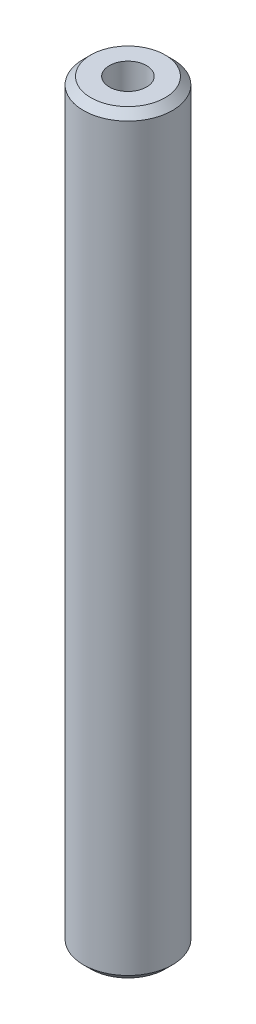
ISO-10303-21;
HEADER;
FILE_DESCRIPTION(('STEP AP214'),'2;1');
FILE_NAME('part.step','',(''),(''),'','','');
FILE_SCHEMA(('AUTOMOTIVE_DESIGN { 1 0 10303 214 1 1 1 1 }'));
ENDSEC;
DATA;
#1=APPLICATION_CONTEXT('core data for automotive mechanical design processes');
#2=APPLICATION_PROTOCOL_DEFINITION('international standard','automotive_design',2000,#1);
#3=PRODUCT_CONTEXT('',#1,'mechanical');
#4=PRODUCT('Part','Part','',(#3));
#5=PRODUCT_RELATED_PRODUCT_CATEGORY('part','',(#4));
#6=PRODUCT_DEFINITION_FORMATION('','',#4);
#7=PRODUCT_DEFINITION_CONTEXT('part definition',#1,'design');
#8=PRODUCT_DEFINITION('design','',#6,#7);
#9=PRODUCT_DEFINITION_SHAPE('','',#8);
#10=(LENGTH_UNIT() NAMED_UNIT(*) SI_UNIT(.MILLI.,.METRE.));
#11=(NAMED_UNIT(*) PLANE_ANGLE_UNIT() SI_UNIT($,.RADIAN.));
#12=(NAMED_UNIT(*) SI_UNIT($,.STERADIAN.) SOLID_ANGLE_UNIT());
#13=UNCERTAINTY_MEASURE_WITH_UNIT(LENGTH_MEASURE(1.E-05),#10,'distance_accuracy_value','');
#14=(GEOMETRIC_REPRESENTATION_CONTEXT(3) GLOBAL_UNCERTAINTY_ASSIGNED_CONTEXT((#13)) GLOBAL_UNIT_ASSIGNED_CONTEXT((#10,
#11,#12)) REPRESENTATION_CONTEXT('',''));
#15=CARTESIAN_POINT('',(0.,0.,0.));
#16=DIRECTION('',(0.,0.,1.));
#17=DIRECTION('',(1.,0.,0.));
#18=AXIS2_PLACEMENT_3D('',#15,#16,#17);
#19=CARTESIAN_POINT('',(0.,127.177910123757,0.));
#20=DIRECTION('',(0.,-1.,0.));
#21=DIRECTION('',(0.,0.,-1.));
#22=AXIS2_PLACEMENT_3D('',#19,#20,#21);
#23=CYLINDRICAL_SURFACE('',#22,7.5);
#24=CARTESIAN_POINT('',(0.,125.934970196319,0.));
#25=DIRECTION('',(0.,1.,0.));
#26=DIRECTION('',(0.,0.,1.));
#27=AXIS2_PLACEMENT_3D('',#24,#25,#26);
#28=CIRCLE('',#27,7.5);
#29=CARTESIAN_POINT('',(0.,125.934970196319,7.5));
#30=VERTEX_POINT('',#29);
#31=EDGE_CURVE('E50',#30,#30,#28,.F.);
#32=ORIENTED_EDGE('',*,*,#31,.T.);
#33=EDGE_LOOP('',(#32));
#34=FACE_BOUND('',#33,.T.);
#35=CARTESIAN_POINT('',(0.,1.24293992743776,0.));
#36=DIRECTION('',(0.,1.,0.));
#37=DIRECTION('',(0.,0.,1.));
#38=AXIS2_PLACEMENT_3D('',#35,#36,#37);
#39=CIRCLE('',#38,7.5);
#40=CARTESIAN_POINT('',(0.,1.24293992743776,7.5));
#41=VERTEX_POINT('',#40);
#42=EDGE_CURVE('E51',#41,#41,#39,.T.);
#43=ORIENTED_EDGE('',*,*,#42,.T.);
#44=EDGE_LOOP('',(#43));
#45=FACE_BOUND('',#44,.T.);
#46=ADVANCED_FACE('F39',(#34,#45),#23,.T.);
#47=CARTESIAN_POINT('',(0.,127.177910123757,0.));
#48=DIRECTION('',(0.,1.,0.));
#49=DIRECTION('',(0.,0.,1.));
#50=AXIS2_PLACEMENT_3D('',#47,#48,#49);
#51=PLANE('',#50);
#52=CARTESIAN_POINT('',(0.,127.177910123757,0.));
#53=DIRECTION('',(0.,1.,0.));
#54=DIRECTION('',(0.,0.,1.));
#55=AXIS2_PLACEMENT_3D('',#52,#53,#54);
#56=CIRCLE('',#55,6.25706007256224);
#57=CARTESIAN_POINT('',(0.,127.177910123757,6.25706007256224));
#58=VERTEX_POINT('',#57);
#59=EDGE_CURVE('E54',#58,#58,#56,.T.);
#60=ORIENTED_EDGE('',*,*,#59,.T.);
#61=EDGE_LOOP('',(#60));
#62=FACE_BOUND('',#61,.T.);
#63=CARTESIAN_POINT('',(0.,127.177910123757,0.));
#64=DIRECTION('',(0.,1.,0.));
#65=DIRECTION('',(0.,0.,1.));
#66=AXIS2_PLACEMENT_3D('',#63,#64,#65);
#67=CIRCLE('',#66,3.13412122204799);
#68=CARTESIAN_POINT('',(0.,127.177910123757,3.13412122204799));
#69=VERTEX_POINT('',#68);
#70=EDGE_CURVE('E58',#69,#69,#67,.T.);
#71=ORIENTED_EDGE('',*,*,#70,.F.);
#72=EDGE_LOOP('',(#71));
#73=FACE_BOUND('',#72,.T.);
#74=ADVANCED_FACE('F69',(#62,#73),#51,.T.);
#75=CARTESIAN_POINT('',(0.,0.,0.));
#76=DIRECTION('',(0.,1.,0.));
#77=DIRECTION('',(0.,0.,1.));
#78=AXIS2_PLACEMENT_3D('',#75,#76,#77);
#79=PLANE('',#78);
#80=CARTESIAN_POINT('',(0.,0.,0.));
#81=DIRECTION('',(0.,1.,0.));
#82=DIRECTION('',(0.,0.,1.));
#83=AXIS2_PLACEMENT_3D('',#80,#81,#82);
#84=CIRCLE('',#83,6.25706007256223);
#85=CARTESIAN_POINT('',(0.,0.,6.25706007256223));
#86=VERTEX_POINT('',#85);
#87=EDGE_CURVE('E10',#86,#86,#84,.F.);
#88=ORIENTED_EDGE('',*,*,#87,.T.);
#89=EDGE_LOOP('',(#88));
#90=FACE_BOUND('',#89,.T.);
#91=CARTESIAN_POINT('',(0.,0.,0.));
#92=DIRECTION('',(0.,1.,0.));
#93=DIRECTION('',(0.,0.,1.));
#94=AXIS2_PLACEMENT_3D('',#91,#92,#93);
#95=CIRCLE('',#94,3.13412122204799);
#96=CARTESIAN_POINT('',(0.,0.,3.13412122204799));
#97=VERTEX_POINT('',#96);
#98=EDGE_CURVE('E63',#97,#97,#95,.T.);
#99=ORIENTED_EDGE('',*,*,#98,.T.);
#100=EDGE_LOOP('',(#99));
#101=FACE_BOUND('',#100,.T.);
#102=ADVANCED_FACE('F75',(#90,#101),#79,.F.);
#103=CARTESIAN_POINT('',(0.,127.177910123757,0.));
#104=DIRECTION('',(0.,-1.,0.));
#105=DIRECTION('',(0.,0.,-1.));
#106=AXIS2_PLACEMENT_3D('',#103,#104,#105);
#107=CYLINDRICAL_SURFACE('',#106,3.13412122204799);
#108=ORIENTED_EDGE('',*,*,#70,.T.);
#109=EDGE_LOOP('',(#108));
#110=FACE_BOUND('',#109,.T.);
#111=ORIENTED_EDGE('',*,*,#98,.F.);
#112=EDGE_LOOP('',(#111));
#113=FACE_BOUND('',#112,.T.);
#114=ADVANCED_FACE('F70',(#110,#113),#107,.F.);
#115=CARTESIAN_POINT('',(0.,127.177910123757,0.));
#116=DIRECTION('',(0.,-1.,0.));
#117=DIRECTION('',(0.,0.,-1.));
#118=AXIS2_PLACEMENT_3D('',#115,#116,#117);
#119=CONICAL_SURFACE('',#118,6.25706007256224,0.785398163397446);
#120=ORIENTED_EDGE('',*,*,#31,.F.);
#121=EDGE_LOOP('',(#120));
#122=FACE_BOUND('',#121,.T.);
#123=ORIENTED_EDGE('',*,*,#59,.F.);
#124=EDGE_LOOP('',(#123));
#125=FACE_BOUND('',#124,.T.);
#126=ADVANCED_FACE('F81',(#122,#125),#119,.T.);
#127=CARTESIAN_POINT('',(0.,1.24293992743776,0.));
#128=DIRECTION('',(0.,1.,0.));
#129=DIRECTION('',(0.,0.,1.));
#130=AXIS2_PLACEMENT_3D('',#127,#128,#129);
#131=CONICAL_SURFACE('',#130,7.5,0.785398163397451);
#132=ORIENTED_EDGE('',*,*,#87,.F.);
#133=EDGE_LOOP('',(#132));
#134=FACE_BOUND('',#133,.T.);
#135=ORIENTED_EDGE('',*,*,#42,.F.);
#136=EDGE_LOOP('',(#135));
#137=FACE_BOUND('',#136,.T.);
#138=ADVANCED_FACE('F45',(#134,#137),#131,.T.);
#139=CLOSED_SHELL('',(#46,#74,#102,#114,#126,#138));
#140=MANIFOLD_SOLID_BREP('B2',#139);
#141=ADVANCED_BREP_SHAPE_REPRESENTATION('',(#18,#140),#14);
#142=SHAPE_DEFINITION_REPRESENTATION(#9,#141);
ENDSEC;
END-ISO-10303-21;
